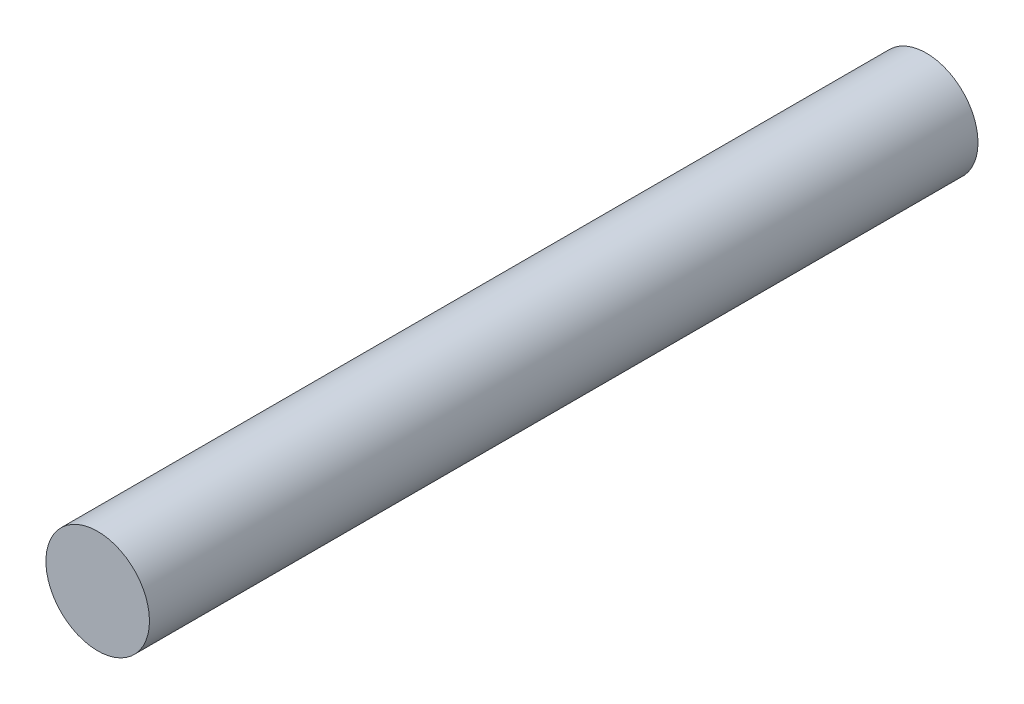
ISO-10303-21;
HEADER;
FILE_DESCRIPTION(('STEP AP214'),'2;1');
FILE_NAME('part.step','',(''),(''),'','','');
FILE_SCHEMA(('AUTOMOTIVE_DESIGN { 1 0 10303 214 1 1 1 1 }'));
ENDSEC;
DATA;
#1=APPLICATION_CONTEXT('core data for automotive mechanical design processes');
#2=APPLICATION_PROTOCOL_DEFINITION('international standard','automotive_design',2000,#1);
#3=PRODUCT_CONTEXT('',#1,'mechanical');
#4=PRODUCT('Part','Part','',(#3));
#5=PRODUCT_RELATED_PRODUCT_CATEGORY('part','',(#4));
#6=PRODUCT_DEFINITION_FORMATION('','',#4);
#7=PRODUCT_DEFINITION_CONTEXT('part definition',#1,'design');
#8=PRODUCT_DEFINITION('design','',#6,#7);
#9=PRODUCT_DEFINITION_SHAPE('','',#8);
#10=(LENGTH_UNIT() NAMED_UNIT(*) SI_UNIT(.MILLI.,.METRE.));
#11=(NAMED_UNIT(*) PLANE_ANGLE_UNIT() SI_UNIT($,.RADIAN.));
#12=(NAMED_UNIT(*) SI_UNIT($,.STERADIAN.) SOLID_ANGLE_UNIT());
#13=UNCERTAINTY_MEASURE_WITH_UNIT(LENGTH_MEASURE(1.E-05),#10,'distance_accuracy_value','');
#14=(GEOMETRIC_REPRESENTATION_CONTEXT(3) GLOBAL_UNCERTAINTY_ASSIGNED_CONTEXT((#13)) GLOBAL_UNIT_ASSIGNED_CONTEXT((#10,
#11,#12)) REPRESENTATION_CONTEXT('',''));
#15=CARTESIAN_POINT('',(0.,0.,0.));
#16=DIRECTION('',(0.,0.,1.));
#17=DIRECTION('',(1.,0.,0.));
#18=AXIS2_PLACEMENT_3D('',#15,#16,#17);
#19=CARTESIAN_POINT('',(0.,0.,40.));
#20=DIRECTION('',(0.,0.,-1.));
#21=DIRECTION('',(-1.,0.,0.));
#22=AXIS2_PLACEMENT_3D('',#19,#20,#21);
#23=CYLINDRICAL_SURFACE('',#22,2.5);
#24=CARTESIAN_POINT('',(0.,0.,40.));
#25=DIRECTION('',(0.,0.,1.));
#26=DIRECTION('',(1.,0.,0.));
#27=AXIS2_PLACEMENT_3D('',#24,#25,#26);
#28=CIRCLE('',#27,2.5);
#29=CARTESIAN_POINT('',(2.5,0.,40.));
#30=VERTEX_POINT('',#29);
#31=EDGE_CURVE('E10',#30,#30,#28,.T.);
#32=ORIENTED_EDGE('',*,*,#31,.F.);
#33=EDGE_LOOP('',(#32));
#34=FACE_BOUND('',#33,.T.);
#35=CARTESIAN_POINT('',(0.,0.,0.));
#36=DIRECTION('',(0.,0.,1.));
#37=DIRECTION('',(1.,0.,0.));
#38=AXIS2_PLACEMENT_3D('',#35,#36,#37);
#39=CIRCLE('',#38,2.5);
#40=CARTESIAN_POINT('',(2.5,0.,0.));
#41=VERTEX_POINT('',#40);
#42=EDGE_CURVE('E44',#41,#41,#39,.T.);
#43=ORIENTED_EDGE('',*,*,#42,.T.);
#44=EDGE_LOOP('',(#43));
#45=FACE_BOUND('',#44,.T.);
#46=ADVANCED_FACE('F41',(#34,#45),#23,.T.);
#47=CARTESIAN_POINT('',(0.,0.,40.));
#48=DIRECTION('',(0.,0.,1.));
#49=DIRECTION('',(1.,0.,0.));
#50=AXIS2_PLACEMENT_3D('',#47,#48,#49);
#51=PLANE('',#50);
#52=ORIENTED_EDGE('',*,*,#31,.T.);
#53=EDGE_LOOP('',(#52));
#54=FACE_BOUND('',#53,.T.);
#55=ADVANCED_FACE('F58',(#54),#51,.T.);
#56=CARTESIAN_POINT('',(0.,0.,0.));
#57=DIRECTION('',(0.,0.,1.));
#58=DIRECTION('',(1.,0.,0.));
#59=AXIS2_PLACEMENT_3D('',#56,#57,#58);
#60=PLANE('',#59);
#61=ORIENTED_EDGE('',*,*,#42,.F.);
#62=EDGE_LOOP('',(#61));
#63=FACE_BOUND('',#62,.T.);
#64=ADVANCED_FACE('F56',(#63),#60,.F.);
#65=CLOSED_SHELL('',(#46,#55,#64));
#66=MANIFOLD_SOLID_BREP('B2',#65);
#67=ADVANCED_BREP_SHAPE_REPRESENTATION('',(#18,#66),#14);
#68=SHAPE_DEFINITION_REPRESENTATION(#9,#67);
ENDSEC;
END-ISO-10303-21;
